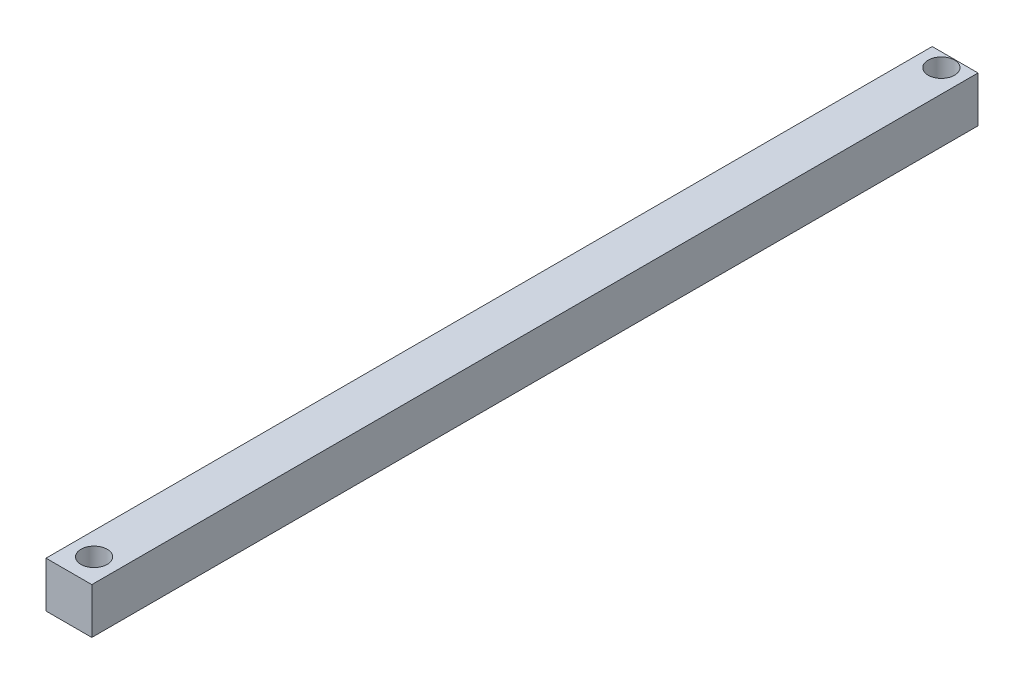
ISO-10303-21;
HEADER;
FILE_DESCRIPTION(('STEP AP214'),'2;1');
FILE_NAME('part.step','',(''),(''),'','','');
FILE_SCHEMA(('AUTOMOTIVE_DESIGN { 1 0 10303 214 1 1 1 1 }'));
ENDSEC;
DATA;
#1=APPLICATION_CONTEXT('core data for automotive mechanical design processes');
#2=APPLICATION_PROTOCOL_DEFINITION('international standard','automotive_design',2000,#1);
#3=PRODUCT_CONTEXT('',#1,'mechanical');
#4=PRODUCT('Part','Part','',(#3));
#5=PRODUCT_RELATED_PRODUCT_CATEGORY('part','',(#4));
#6=PRODUCT_DEFINITION_FORMATION('','',#4);
#7=PRODUCT_DEFINITION_CONTEXT('part definition',#1,'design');
#8=PRODUCT_DEFINITION('design','',#6,#7);
#9=PRODUCT_DEFINITION_SHAPE('','',#8);
#10=(LENGTH_UNIT() NAMED_UNIT(*) SI_UNIT(.MILLI.,.METRE.));
#11=(NAMED_UNIT(*) PLANE_ANGLE_UNIT() SI_UNIT($,.RADIAN.));
#12=(NAMED_UNIT(*) SI_UNIT($,.STERADIAN.) SOLID_ANGLE_UNIT());
#13=UNCERTAINTY_MEASURE_WITH_UNIT(LENGTH_MEASURE(1.E-05),#10,'distance_accuracy_value','');
#14=(GEOMETRIC_REPRESENTATION_CONTEXT(3) GLOBAL_UNCERTAINTY_ASSIGNED_CONTEXT((#13)) GLOBAL_UNIT_ASSIGNED_CONTEXT((#10,
#11,#12)) REPRESENTATION_CONTEXT('',''));
#15=CARTESIAN_POINT('',(0.,0.,0.));
#16=DIRECTION('',(0.,0.,1.));
#17=DIRECTION('',(1.,0.,0.));
#18=AXIS2_PLACEMENT_3D('',#15,#16,#17);
#19=CARTESIAN_POINT('',(9.99999999999997,20.,-193.5));
#20=DIRECTION('',(-1.,0.,0.));
#21=DIRECTION('',(0.,0.,1.));
#22=AXIS2_PLACEMENT_3D('',#19,#20,#21);
#23=PLANE('',#22);
#24=DIRECTION('',(0.,0.,-1.));
#25=VECTOR('',#24,1.);
#26=CARTESIAN_POINT('',(9.99999999999997,0.,-193.5));
#27=LINE('',#26,#25);
#28=CARTESIAN_POINT('',(10.,0.,193.5));
#29=VERTEX_POINT('',#28);
#30=CARTESIAN_POINT('',(9.99999999999997,0.,-193.5));
#31=VERTEX_POINT('',#30);
#32=EDGE_CURVE('E109',#29,#31,#27,.T.);
#33=ORIENTED_EDGE('',*,*,#32,.T.);
#34=DIRECTION('',(0.,-1.,0.));
#35=VECTOR('',#34,1.);
#36=CARTESIAN_POINT('',(9.99999999999997,20.,-193.5));
#37=LINE('',#36,#35);
#38=CARTESIAN_POINT('',(9.99999999999997,20.,-193.5));
#39=VERTEX_POINT('',#38);
#40=EDGE_CURVE('E11',#39,#31,#37,.T.);
#41=ORIENTED_EDGE('',*,*,#40,.F.);
#42=DIRECTION('',(0.,0.,-1.));
#43=VECTOR('',#42,1.);
#44=CARTESIAN_POINT('',(9.99999999999997,20.,-193.5));
#45=LINE('',#44,#43);
#46=CARTESIAN_POINT('',(10.,20.,193.5));
#47=VERTEX_POINT('',#46);
#48=EDGE_CURVE('E93',#47,#39,#45,.T.);
#49=ORIENTED_EDGE('',*,*,#48,.F.);
#50=DIRECTION('',(0.,-1.,0.));
#51=VECTOR('',#50,1.);
#52=CARTESIAN_POINT('',(10.,20.,193.5));
#53=LINE('',#52,#51);
#54=EDGE_CURVE('E105',#47,#29,#53,.T.);
#55=ORIENTED_EDGE('',*,*,#54,.T.);
#56=EDGE_LOOP('',(#33,#41,#49,#55));
#57=FACE_BOUND('',#56,.T.);
#58=ADVANCED_FACE('F41',(#57),#23,.F.);
#59=CARTESIAN_POINT('',(-10.,20.,-193.5));
#60=DIRECTION('',(0.,0.,1.));
#61=DIRECTION('',(1.,0.,0.));
#62=AXIS2_PLACEMENT_3D('',#59,#60,#61);
#63=PLANE('',#62);
#64=DIRECTION('',(-1.,0.,0.));
#65=VECTOR('',#64,1.);
#66=CARTESIAN_POINT('',(-10.,0.,-193.5));
#67=LINE('',#66,#65);
#68=CARTESIAN_POINT('',(-10.,0.,-193.5));
#69=VERTEX_POINT('',#68);
#70=EDGE_CURVE('E98',#31,#69,#67,.T.);
#71=ORIENTED_EDGE('',*,*,#70,.T.);
#72=DIRECTION('',(0.,-1.,0.));
#73=VECTOR('',#72,1.);
#74=CARTESIAN_POINT('',(-10.,20.,-193.5));
#75=LINE('',#74,#73);
#76=CARTESIAN_POINT('',(-10.,20.,-193.5));
#77=VERTEX_POINT('',#76);
#78=EDGE_CURVE('E50',#77,#69,#75,.T.);
#79=ORIENTED_EDGE('',*,*,#78,.F.);
#80=DIRECTION('',(-1.,0.,0.));
#81=VECTOR('',#80,1.);
#82=CARTESIAN_POINT('',(-10.,20.,-193.5));
#83=LINE('',#82,#81);
#84=EDGE_CURVE('E88',#39,#77,#83,.T.);
#85=ORIENTED_EDGE('',*,*,#84,.F.);
#86=ORIENTED_EDGE('',*,*,#40,.T.);
#87=EDGE_LOOP('',(#71,#79,#85,#86));
#88=FACE_BOUND('',#87,.T.);
#89=ADVANCED_FACE('F97',(#88),#63,.F.);
#90=CARTESIAN_POINT('',(-10.,20.,-193.5));
#91=DIRECTION('',(1.,0.,0.));
#92=DIRECTION('',(0.,0.,-1.));
#93=AXIS2_PLACEMENT_3D('',#90,#91,#92);
#94=PLANE('',#93);
#95=DIRECTION('',(0.,0.,1.));
#96=VECTOR('',#95,1.);
#97=CARTESIAN_POINT('',(-10.,0.,-193.5));
#98=LINE('',#97,#96);
#99=CARTESIAN_POINT('',(-9.99999999999998,0.,193.5));
#100=VERTEX_POINT('',#99);
#101=EDGE_CURVE('E75',#69,#100,#98,.T.);
#102=ORIENTED_EDGE('',*,*,#101,.T.);
#103=DIRECTION('',(0.,-1.,0.));
#104=VECTOR('',#103,1.);
#105=CARTESIAN_POINT('',(-9.99999999999998,20.,193.5));
#106=LINE('',#105,#104);
#107=CARTESIAN_POINT('',(-9.99999999999998,20.,193.5));
#108=VERTEX_POINT('',#107);
#109=EDGE_CURVE('E100',#108,#100,#106,.T.);
#110=ORIENTED_EDGE('',*,*,#109,.F.);
#111=DIRECTION('',(0.,0.,1.));
#112=VECTOR('',#111,1.);
#113=CARTESIAN_POINT('',(-10.,20.,-193.5));
#114=LINE('',#113,#112);
#115=EDGE_CURVE('E91',#77,#108,#114,.T.);
#116=ORIENTED_EDGE('',*,*,#115,.F.);
#117=ORIENTED_EDGE('',*,*,#78,.T.);
#118=EDGE_LOOP('',(#102,#110,#116,#117));
#119=FACE_BOUND('',#118,.T.);
#120=ADVANCED_FACE('F101',(#119),#94,.F.);
#121=CARTESIAN_POINT('',(-9.99999999999998,20.,193.5));
#122=DIRECTION('',(0.,0.,-1.));
#123=DIRECTION('',(-1.,0.,0.));
#124=AXIS2_PLACEMENT_3D('',#121,#122,#123);
#125=PLANE('',#124);
#126=DIRECTION('',(1.,0.,0.));
#127=VECTOR('',#126,1.);
#128=CARTESIAN_POINT('',(-9.99999999999998,0.,193.5));
#129=LINE('',#128,#127);
#130=EDGE_CURVE('E81',#100,#29,#129,.T.);
#131=ORIENTED_EDGE('',*,*,#130,.T.);
#132=ORIENTED_EDGE('',*,*,#54,.F.);
#133=DIRECTION('',(1.,0.,0.));
#134=VECTOR('',#133,1.);
#135=CARTESIAN_POINT('',(-9.99999999999998,20.,193.5));
#136=LINE('',#135,#134);
#137=EDGE_CURVE('E58',#108,#47,#136,.T.);
#138=ORIENTED_EDGE('',*,*,#137,.F.);
#139=ORIENTED_EDGE('',*,*,#109,.T.);
#140=EDGE_LOOP('',(#131,#132,#138,#139));
#141=FACE_BOUND('',#140,.T.);
#142=ADVANCED_FACE('F123',(#141),#125,.F.);
#143=CARTESIAN_POINT('',(0.,20.,0.));
#144=DIRECTION('',(0.,1.,0.));
#145=DIRECTION('',(0.,0.,1.));
#146=AXIS2_PLACEMENT_3D('',#143,#144,#145);
#147=PLANE('',#146);
#148=CARTESIAN_POINT('',(0.,20.,-187.5));
#149=DIRECTION('',(0.,1.,0.));
#150=DIRECTION('',(0.,0.,1.));
#151=AXIS2_PLACEMENT_3D('',#148,#149,#150);
#152=CIRCLE('',#151,5.75000000000001);
#153=CARTESIAN_POINT('',(0.,20.,-181.75));
#154=VERTEX_POINT('',#153);
#155=EDGE_CURVE('E138',#154,#154,#152,.T.);
#156=ORIENTED_EDGE('',*,*,#155,.F.);
#157=EDGE_LOOP('',(#156));
#158=FACE_BOUND('',#157,.T.);
#159=CARTESIAN_POINT('',(0.,20.,182.5));
#160=DIRECTION('',(0.,1.,0.));
#161=DIRECTION('',(0.,0.,1.));
#162=AXIS2_PLACEMENT_3D('',#159,#160,#161);
#163=CIRCLE('',#162,5.75000000000001);
#164=CARTESIAN_POINT('',(0.,20.,188.25));
#165=VERTEX_POINT('',#164);
#166=EDGE_CURVE('E130',#165,#165,#163,.T.);
#167=ORIENTED_EDGE('',*,*,#166,.F.);
#168=EDGE_LOOP('',(#167));
#169=FACE_BOUND('',#168,.T.);
#170=ORIENTED_EDGE('',*,*,#48,.T.);
#171=ORIENTED_EDGE('',*,*,#84,.T.);
#172=ORIENTED_EDGE('',*,*,#115,.T.);
#173=ORIENTED_EDGE('',*,*,#137,.T.);
#174=EDGE_LOOP('',(#170,#171,#172,#173));
#175=FACE_BOUND('',#174,.T.);
#176=ADVANCED_FACE('F89',(#158,#169,#175),#147,.T.);
#177=CARTESIAN_POINT('',(0.,0.,0.));
#178=DIRECTION('',(0.,1.,0.));
#179=DIRECTION('',(0.,0.,1.));
#180=AXIS2_PLACEMENT_3D('',#177,#178,#179);
#181=PLANE('',#180);
#182=CARTESIAN_POINT('',(0.,0.,-187.5));
#183=DIRECTION('',(0.,1.,0.));
#184=DIRECTION('',(0.,0.,1.));
#185=AXIS2_PLACEMENT_3D('',#182,#183,#184);
#186=CIRCLE('',#185,5.75000000000001);
#187=CARTESIAN_POINT('',(0.,0.,-181.75));
#188=VERTEX_POINT('',#187);
#189=EDGE_CURVE('E113',#188,#188,#186,.T.);
#190=ORIENTED_EDGE('',*,*,#189,.T.);
#191=EDGE_LOOP('',(#190));
#192=FACE_BOUND('',#191,.T.);
#193=CARTESIAN_POINT('',(0.,0.,182.5));
#194=DIRECTION('',(0.,1.,0.));
#195=DIRECTION('',(0.,0.,1.));
#196=AXIS2_PLACEMENT_3D('',#193,#194,#195);
#197=CIRCLE('',#196,5.75000000000001);
#198=CARTESIAN_POINT('',(0.,0.,188.25));
#199=VERTEX_POINT('',#198);
#200=EDGE_CURVE('E134',#199,#199,#197,.T.);
#201=ORIENTED_EDGE('',*,*,#200,.T.);
#202=EDGE_LOOP('',(#201));
#203=FACE_BOUND('',#202,.T.);
#204=ORIENTED_EDGE('',*,*,#32,.F.);
#205=ORIENTED_EDGE('',*,*,#130,.F.);
#206=ORIENTED_EDGE('',*,*,#101,.F.);
#207=ORIENTED_EDGE('',*,*,#70,.F.);
#208=EDGE_LOOP('',(#204,#205,#206,#207));
#209=FACE_BOUND('',#208,.T.);
#210=ADVANCED_FACE('F126',(#192,#203,#209),#181,.F.);
#211=CARTESIAN_POINT('',(0.,0.,182.5));
#212=DIRECTION('',(0.,1.,0.));
#213=DIRECTION('',(0.,0.,1.));
#214=AXIS2_PLACEMENT_3D('',#211,#212,#213);
#215=CYLINDRICAL_SURFACE('',#214,5.75000000000001);
#216=ORIENTED_EDGE('',*,*,#200,.F.);
#217=EDGE_LOOP('',(#216));
#218=FACE_BOUND('',#217,.T.);
#219=ORIENTED_EDGE('',*,*,#166,.T.);
#220=EDGE_LOOP('',(#219));
#221=FACE_BOUND('',#220,.T.);
#222=ADVANCED_FACE('F151',(#218,#221),#215,.F.);
#223=CARTESIAN_POINT('',(0.,0.,-187.5));
#224=DIRECTION('',(0.,1.,0.));
#225=DIRECTION('',(0.,0.,1.));
#226=AXIS2_PLACEMENT_3D('',#223,#224,#225);
#227=CYLINDRICAL_SURFACE('',#226,5.75000000000001);
#228=ORIENTED_EDGE('',*,*,#189,.F.);
#229=EDGE_LOOP('',(#228));
#230=FACE_BOUND('',#229,.T.);
#231=ORIENTED_EDGE('',*,*,#155,.T.);
#232=EDGE_LOOP('',(#231));
#233=FACE_BOUND('',#232,.T.);
#234=ADVANCED_FACE('F148',(#230,#233),#227,.F.);
#235=CLOSED_SHELL('',(#58,#89,#120,#142,#176,#210,#222,#234));
#236=MANIFOLD_SOLID_BREP('B2',#235);
#237=ADVANCED_BREP_SHAPE_REPRESENTATION('',(#18,#236),#14);
#238=SHAPE_DEFINITION_REPRESENTATION(#9,#237);
ENDSEC;
END-ISO-10303-21;
